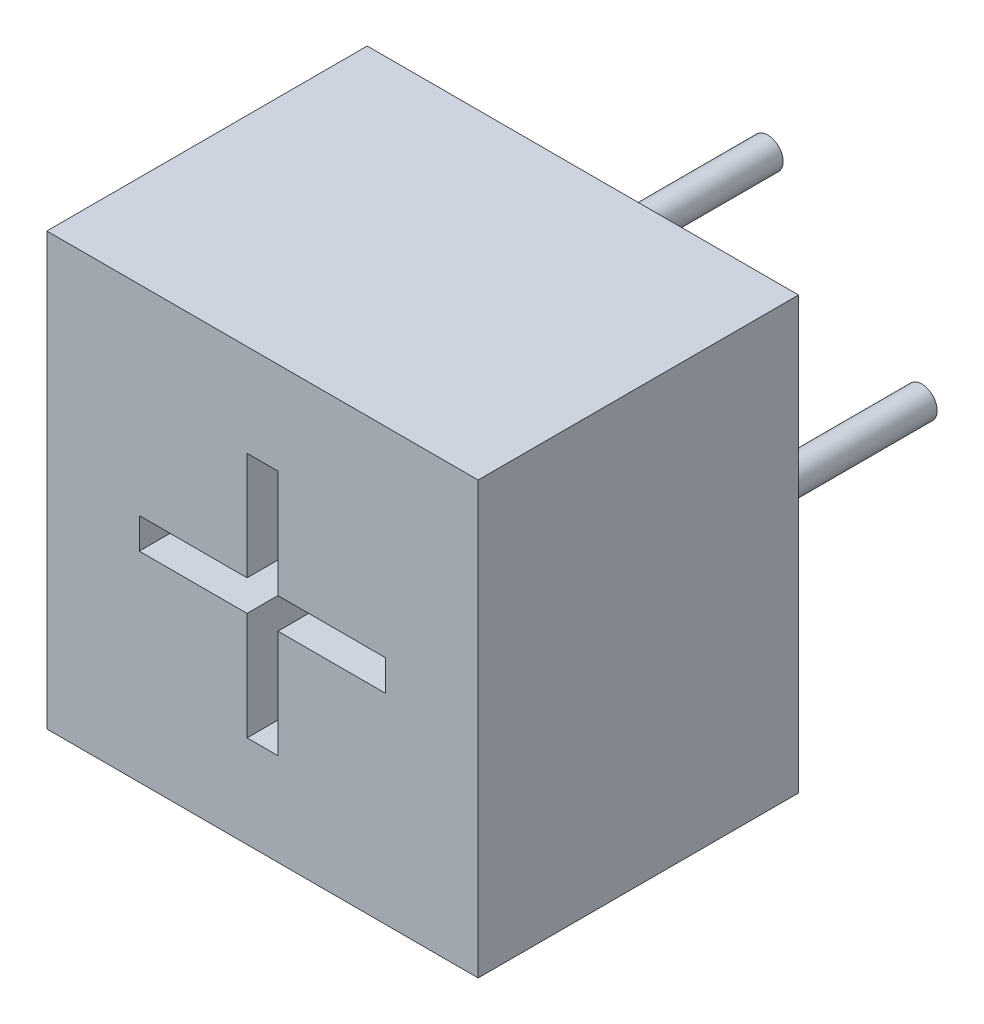
ISO-10303-21;
HEADER;
FILE_DESCRIPTION(('STEP AP214'),'2;1');
FILE_NAME('part.step','',(''),(''),'','','');
FILE_SCHEMA(('AUTOMOTIVE_DESIGN { 1 0 10303 214 1 1 1 1 }'));
ENDSEC;
DATA;
#1=APPLICATION_CONTEXT('core data for automotive mechanical design processes');
#2=APPLICATION_PROTOCOL_DEFINITION('international standard','automotive_design',2000,#1);
#3=PRODUCT_CONTEXT('',#1,'mechanical');
#4=PRODUCT('Part','Part','',(#3));
#5=PRODUCT_RELATED_PRODUCT_CATEGORY('part','',(#4));
#6=PRODUCT_DEFINITION_FORMATION('','',#4);
#7=PRODUCT_DEFINITION_CONTEXT('part definition',#1,'design');
#8=PRODUCT_DEFINITION('design','',#6,#7);
#9=PRODUCT_DEFINITION_SHAPE('','',#8);
#10=(LENGTH_UNIT() NAMED_UNIT(*) SI_UNIT(.MILLI.,.METRE.));
#11=(NAMED_UNIT(*) PLANE_ANGLE_UNIT() SI_UNIT($,.RADIAN.));
#12=(NAMED_UNIT(*) SI_UNIT($,.STERADIAN.) SOLID_ANGLE_UNIT());
#13=UNCERTAINTY_MEASURE_WITH_UNIT(LENGTH_MEASURE(1.E-05),#10,'distance_accuracy_value','');
#14=(GEOMETRIC_REPRESENTATION_CONTEXT(3) GLOBAL_UNCERTAINTY_ASSIGNED_CONTEXT((#13)) GLOBAL_UNIT_ASSIGNED_CONTEXT((#10,
#11,#12)) REPRESENTATION_CONTEXT('',''));
#15=CARTESIAN_POINT('',(0.,0.,0.));
#16=DIRECTION('',(0.,0.,1.));
#17=DIRECTION('',(1.,0.,0.));
#18=AXIS2_PLACEMENT_3D('',#15,#16,#17);
#19=CARTESIAN_POINT('',(3.5,-3.5,5.2));
#20=DIRECTION('',(-1.,0.,0.));
#21=DIRECTION('',(0.,0.,1.));
#22=AXIS2_PLACEMENT_3D('',#19,#20,#21);
#23=PLANE('',#22);
#24=DIRECTION('',(0.,1.,0.));
#25=VECTOR('',#24,1.);
#26=CARTESIAN_POINT('',(3.5,-3.5,0.));
#27=LINE('',#26,#25);
#28=CARTESIAN_POINT('',(3.5,-3.5,0.));
#29=VERTEX_POINT('',#28);
#30=CARTESIAN_POINT('',(3.5,3.5,0.));
#31=VERTEX_POINT('',#30);
#32=EDGE_CURVE('E295',#29,#31,#27,.T.);
#33=ORIENTED_EDGE('',*,*,#32,.T.);
#34=DIRECTION('',(0.,0.,-1.));
#35=VECTOR('',#34,1.);
#36=CARTESIAN_POINT('',(3.5,3.5,5.2));
#37=LINE('',#36,#35);
#38=CARTESIAN_POINT('',(3.5,3.5,5.2));
#39=VERTEX_POINT('',#38);
#40=EDGE_CURVE('E12',#39,#31,#37,.T.);
#41=ORIENTED_EDGE('',*,*,#40,.F.);
#42=DIRECTION('',(0.,1.,0.));
#43=VECTOR('',#42,1.);
#44=CARTESIAN_POINT('',(3.5,-3.5,5.2));
#45=LINE('',#44,#43);
#46=CARTESIAN_POINT('',(3.5,-3.5,5.2));
#47=VERTEX_POINT('',#46);
#48=EDGE_CURVE('E296',#47,#39,#45,.T.);
#49=ORIENTED_EDGE('',*,*,#48,.F.);
#50=DIRECTION('',(0.,0.,-1.));
#51=VECTOR('',#50,1.);
#52=CARTESIAN_POINT('',(3.5,-3.5,5.2));
#53=LINE('',#52,#51);
#54=EDGE_CURVE('E302',#47,#29,#53,.T.);
#55=ORIENTED_EDGE('',*,*,#54,.T.);
#56=EDGE_LOOP('',(#33,#41,#49,#55));
#57=FACE_BOUND('',#56,.T.);
#58=ADVANCED_FACE('F71',(#57),#23,.F.);
#59=CARTESIAN_POINT('',(-3.5,3.5,5.2));
#60=DIRECTION('',(0.,-1.,0.));
#61=DIRECTION('',(0.,0.,-1.));
#62=AXIS2_PLACEMENT_3D('',#59,#60,#61);
#63=PLANE('',#62);
#64=DIRECTION('',(-1.,0.,0.));
#65=VECTOR('',#64,1.);
#66=CARTESIAN_POINT('',(-3.5,3.5,0.));
#67=LINE('',#66,#65);
#68=CARTESIAN_POINT('',(-3.5,3.5,0.));
#69=VERTEX_POINT('',#68);
#70=EDGE_CURVE('E305',#31,#69,#67,.T.);
#71=ORIENTED_EDGE('',*,*,#70,.T.);
#72=DIRECTION('',(0.,0.,-1.));
#73=VECTOR('',#72,1.);
#74=CARTESIAN_POINT('',(-3.5,3.5,5.2));
#75=LINE('',#74,#73);
#76=CARTESIAN_POINT('',(-3.5,3.5,5.2));
#77=VERTEX_POINT('',#76);
#78=EDGE_CURVE('E78',#77,#69,#75,.T.);
#79=ORIENTED_EDGE('',*,*,#78,.F.);
#80=DIRECTION('',(-1.,0.,0.));
#81=VECTOR('',#80,1.);
#82=CARTESIAN_POINT('',(-3.5,3.5,5.2));
#83=LINE('',#82,#81);
#84=EDGE_CURVE('E122',#39,#77,#83,.T.);
#85=ORIENTED_EDGE('',*,*,#84,.F.);
#86=ORIENTED_EDGE('',*,*,#40,.T.);
#87=EDGE_LOOP('',(#71,#79,#85,#86));
#88=FACE_BOUND('',#87,.T.);
#89=ADVANCED_FACE('F334',(#88),#63,.F.);
#90=CARTESIAN_POINT('',(-3.5,-3.5,5.2));
#91=DIRECTION('',(1.,0.,0.));
#92=DIRECTION('',(0.,0.,-1.));
#93=AXIS2_PLACEMENT_3D('',#90,#91,#92);
#94=PLANE('',#93);
#95=DIRECTION('',(0.,-1.,0.));
#96=VECTOR('',#95,1.);
#97=CARTESIAN_POINT('',(-3.5,-3.5,0.));
#98=LINE('',#97,#96);
#99=CARTESIAN_POINT('',(-3.5,-3.5,0.));
#100=VERTEX_POINT('',#99);
#101=EDGE_CURVE('E307',#69,#100,#98,.T.);
#102=ORIENTED_EDGE('',*,*,#101,.T.);
#103=DIRECTION('',(0.,0.,-1.));
#104=VECTOR('',#103,1.);
#105=CARTESIAN_POINT('',(-3.5,-3.5,5.2));
#106=LINE('',#105,#104);
#107=CARTESIAN_POINT('',(-3.5,-3.5,5.2));
#108=VERTEX_POINT('',#107);
#109=EDGE_CURVE('E311',#108,#100,#106,.T.);
#110=ORIENTED_EDGE('',*,*,#109,.F.);
#111=DIRECTION('',(0.,-1.,0.));
#112=VECTOR('',#111,1.);
#113=CARTESIAN_POINT('',(-3.5,-3.5,5.2));
#114=LINE('',#113,#112);
#115=EDGE_CURVE('E299',#77,#108,#114,.T.);
#116=ORIENTED_EDGE('',*,*,#115,.F.);
#117=ORIENTED_EDGE('',*,*,#78,.T.);
#118=EDGE_LOOP('',(#102,#110,#116,#117));
#119=FACE_BOUND('',#118,.T.);
#120=ADVANCED_FACE('F316',(#119),#94,.F.);
#121=CARTESIAN_POINT('',(-3.5,-3.5,5.2));
#122=DIRECTION('',(0.,1.,0.));
#123=DIRECTION('',(0.,0.,1.));
#124=AXIS2_PLACEMENT_3D('',#121,#122,#123);
#125=PLANE('',#124);
#126=DIRECTION('',(1.,0.,0.));
#127=VECTOR('',#126,1.);
#128=CARTESIAN_POINT('',(-3.5,-3.5,0.));
#129=LINE('',#128,#127);
#130=EDGE_CURVE('E115',#100,#29,#129,.T.);
#131=ORIENTED_EDGE('',*,*,#130,.T.);
#132=ORIENTED_EDGE('',*,*,#54,.F.);
#133=DIRECTION('',(1.,0.,0.));
#134=VECTOR('',#133,1.);
#135=CARTESIAN_POINT('',(-3.5,-3.5,5.2));
#136=LINE('',#135,#134);
#137=EDGE_CURVE('E94',#108,#47,#136,.T.);
#138=ORIENTED_EDGE('',*,*,#137,.F.);
#139=ORIENTED_EDGE('',*,*,#109,.T.);
#140=EDGE_LOOP('',(#131,#132,#138,#139));
#141=FACE_BOUND('',#140,.T.);
#142=ADVANCED_FACE('F324',(#141),#125,.F.);
#143=CARTESIAN_POINT('',(0.,0.,5.2));
#144=DIRECTION('',(0.,0.,-1.));
#145=DIRECTION('',(-1.,0.,0.));
#146=AXIS2_PLACEMENT_3D('',#143,#144,#145);
#147=PLANE('',#146);
#148=DIRECTION('',(0.,1.,0.));
#149=VECTOR('',#148,1.);
#150=CARTESIAN_POINT('',(0.25,0.,5.2));
#151=LINE('',#150,#149);
#152=CARTESIAN_POINT('',(0.25,0.25,5.2));
#153=VERTEX_POINT('',#152);
#154=CARTESIAN_POINT('',(0.25,2.,5.2));
#155=VERTEX_POINT('',#154);
#156=EDGE_CURVE('E241',#153,#155,#151,.T.);
#157=ORIENTED_EDGE('',*,*,#156,.F.);
#158=DIRECTION('',(-1.,0.,0.));
#159=VECTOR('',#158,1.);
#160=CARTESIAN_POINT('',(0.,0.25,5.2));
#161=LINE('',#160,#159);
#162=CARTESIAN_POINT('',(2.,0.25,5.2));
#163=VERTEX_POINT('',#162);
#164=EDGE_CURVE('E199',#163,#153,#161,.T.);
#165=ORIENTED_EDGE('',*,*,#164,.F.);
#166=DIRECTION('',(0.,1.,0.));
#167=VECTOR('',#166,1.);
#168=CARTESIAN_POINT('',(2.,0.,5.2));
#169=LINE('',#168,#167);
#170=CARTESIAN_POINT('',(2.,-0.25,5.2));
#171=VERTEX_POINT('',#170);
#172=EDGE_CURVE('E217',#171,#163,#169,.T.);
#173=ORIENTED_EDGE('',*,*,#172,.F.);
#174=DIRECTION('',(-1.,0.,0.));
#175=VECTOR('',#174,1.);
#176=CARTESIAN_POINT('',(0.,-0.25,5.2));
#177=LINE('',#176,#175);
#178=CARTESIAN_POINT('',(0.25,-0.25,5.2));
#179=VERTEX_POINT('',#178);
#180=EDGE_CURVE('E220',#171,#179,#177,.T.);
#181=ORIENTED_EDGE('',*,*,#180,.T.);
#182=DIRECTION('',(0.,1.,0.));
#183=VECTOR('',#182,1.);
#184=CARTESIAN_POINT('',(0.25,0.,5.2));
#185=LINE('',#184,#183);
#186=CARTESIAN_POINT('',(0.25,-2.,5.2));
#187=VERTEX_POINT('',#186);
#188=EDGE_CURVE('E253',#187,#179,#185,.T.);
#189=ORIENTED_EDGE('',*,*,#188,.F.);
#190=DIRECTION('',(-1.,0.,0.));
#191=VECTOR('',#190,1.);
#192=CARTESIAN_POINT('',(0.,-2.,5.2));
#193=LINE('',#192,#191);
#194=CARTESIAN_POINT('',(-0.25,-2.,5.2));
#195=VERTEX_POINT('',#194);
#196=EDGE_CURVE('E250',#187,#195,#193,.T.);
#197=ORIENTED_EDGE('',*,*,#196,.T.);
#198=DIRECTION('',(0.,1.,0.));
#199=VECTOR('',#198,1.);
#200=CARTESIAN_POINT('',(-0.25,0.,5.2));
#201=LINE('',#200,#199);
#202=CARTESIAN_POINT('',(-0.25,-0.25,5.2));
#203=VERTEX_POINT('',#202);
#204=EDGE_CURVE('E247',#195,#203,#201,.T.);
#205=ORIENTED_EDGE('',*,*,#204,.T.);
#206=DIRECTION('',(-1.,0.,0.));
#207=VECTOR('',#206,1.);
#208=CARTESIAN_POINT('',(2.,-0.25,5.2));
#209=LINE('',#208,#207);
#210=CARTESIAN_POINT('',(-2.,-0.25,5.2));
#211=VERTEX_POINT('',#210);
#212=EDGE_CURVE('E275',#203,#211,#209,.T.);
#213=ORIENTED_EDGE('',*,*,#212,.T.);
#214=DIRECTION('',(0.,1.,0.));
#215=VECTOR('',#214,1.);
#216=CARTESIAN_POINT('',(-2.,-0.25,5.2));
#217=LINE('',#216,#215);
#218=CARTESIAN_POINT('',(-2.,0.25,5.2));
#219=VERTEX_POINT('',#218);
#220=EDGE_CURVE('E283',#211,#219,#217,.T.);
#221=ORIENTED_EDGE('',*,*,#220,.T.);
#222=DIRECTION('',(-1.,0.,0.));
#223=VECTOR('',#222,1.);
#224=CARTESIAN_POINT('',(2.,0.25,5.2));
#225=LINE('',#224,#223);
#226=CARTESIAN_POINT('',(-0.25,0.25,5.2));
#227=VERTEX_POINT('',#226);
#228=EDGE_CURVE('E281',#227,#219,#225,.T.);
#229=ORIENTED_EDGE('',*,*,#228,.F.);
#230=CARTESIAN_POINT('',(-0.25,2.,5.2));
#231=VERTEX_POINT('',#230);
#232=EDGE_CURVE('E85',#227,#231,#201,.T.);
#233=ORIENTED_EDGE('',*,*,#232,.T.);
#234=DIRECTION('',(-1.,0.,0.));
#235=VECTOR('',#234,1.);
#236=CARTESIAN_POINT('',(0.,2.,5.2));
#237=LINE('',#236,#235);
#238=EDGE_CURVE('E244',#155,#231,#237,.T.);
#239=ORIENTED_EDGE('',*,*,#238,.F.);
#240=EDGE_LOOP('',(#157,#165,#173,#181,#189,#197,#205,#213,#221,#229,#233,#239));
#241=FACE_BOUND('',#240,.T.);
#242=ORIENTED_EDGE('',*,*,#48,.T.);
#243=ORIENTED_EDGE('',*,*,#84,.T.);
#244=ORIENTED_EDGE('',*,*,#115,.T.);
#245=ORIENTED_EDGE('',*,*,#137,.T.);
#246=EDGE_LOOP('',(#242,#243,#244,#245));
#247=FACE_BOUND('',#246,.T.);
#248=ADVANCED_FACE('F326',(#241,#247),#147,.F.);
#249=CARTESIAN_POINT('',(0.,0.,0.));
#250=DIRECTION('',(0.,0.,-1.));
#251=DIRECTION('',(-1.,0.,0.));
#252=AXIS2_PLACEMENT_3D('',#249,#250,#251);
#253=PLANE('',#252);
#254=CARTESIAN_POINT('',(2.5,0.,0.));
#255=DIRECTION('',(0.,0.,-1.));
#256=DIRECTION('',(-1.,0.,0.));
#257=AXIS2_PLACEMENT_3D('',#254,#255,#256);
#258=CIRCLE('',#257,0.249999999999999);
#259=CARTESIAN_POINT('',(2.25,0.,0.));
#260=VERTEX_POINT('',#259);
#261=EDGE_CURVE('E560',#260,#260,#258,.T.);
#262=ORIENTED_EDGE('',*,*,#261,.F.);
#263=EDGE_LOOP('',(#262));
#264=FACE_BOUND('',#263,.T.);
#265=CARTESIAN_POINT('',(-2.5,0.,0.));
#266=DIRECTION('',(0.,0.,-1.));
#267=DIRECTION('',(-1.,0.,0.));
#268=AXIS2_PLACEMENT_3D('',#265,#266,#267);
#269=CIRCLE('',#268,0.249999999999999);
#270=CARTESIAN_POINT('',(-2.75,0.,0.));
#271=VERTEX_POINT('',#270);
#272=EDGE_CURVE('E559',#271,#271,#269,.T.);
#273=ORIENTED_EDGE('',*,*,#272,.F.);
#274=EDGE_LOOP('',(#273));
#275=FACE_BOUND('',#274,.T.);
#276=CARTESIAN_POINT('',(0.,2.25,0.));
#277=DIRECTION('',(0.,0.,-1.));
#278=DIRECTION('',(-1.,0.,0.));
#279=AXIS2_PLACEMENT_3D('',#276,#277,#278);
#280=CIRCLE('',#279,0.25);
#281=CARTESIAN_POINT('',(-0.25,2.25,0.));
#282=VERTEX_POINT('',#281);
#283=EDGE_CURVE('E223',#282,#282,#280,.T.);
#284=ORIENTED_EDGE('',*,*,#283,.F.);
#285=EDGE_LOOP('',(#284));
#286=FACE_BOUND('',#285,.T.);
#287=ORIENTED_EDGE('',*,*,#32,.F.);
#288=ORIENTED_EDGE('',*,*,#130,.F.);
#289=ORIENTED_EDGE('',*,*,#101,.F.);
#290=ORIENTED_EDGE('',*,*,#70,.F.);
#291=EDGE_LOOP('',(#287,#288,#289,#290));
#292=FACE_BOUND('',#291,.T.);
#293=ADVANCED_FACE('F320',(#264,#275,#286,#292),#253,.T.);
#294=CARTESIAN_POINT('',(0.,0.25,3.2));
#295=DIRECTION('',(0.,1.,0.));
#296=DIRECTION('',(-1.,0.,0.));
#297=AXIS2_PLACEMENT_3D('',#294,#295,#296);
#298=PLANE('',#297);
#299=ORIENTED_EDGE('',*,*,#164,.T.);
#300=DIRECTION('',(0.,0.,1.));
#301=VECTOR('',#300,1.);
#302=CARTESIAN_POINT('',(0.25,0.25,3.2));
#303=LINE('',#302,#301);
#304=CARTESIAN_POINT('',(0.25,0.25,3.2));
#305=VERTEX_POINT('',#304);
#306=EDGE_CURVE('E192',#305,#153,#303,.T.);
#307=ORIENTED_EDGE('',*,*,#306,.F.);
#308=DIRECTION('',(-1.,0.,0.));
#309=VECTOR('',#308,1.);
#310=CARTESIAN_POINT('',(0.,0.25,3.2));
#311=LINE('',#310,#309);
#312=CARTESIAN_POINT('',(2.,0.25,3.2));
#313=VERTEX_POINT('',#312);
#314=EDGE_CURVE('E196',#313,#305,#311,.T.);
#315=ORIENTED_EDGE('',*,*,#314,.F.);
#316=DIRECTION('',(0.,0.,1.));
#317=VECTOR('',#316,1.);
#318=CARTESIAN_POINT('',(2.,0.25,3.2));
#319=LINE('',#318,#317);
#320=EDGE_CURVE('E258',#313,#163,#319,.T.);
#321=ORIENTED_EDGE('',*,*,#320,.T.);
#322=EDGE_LOOP('',(#299,#307,#315,#321));
#323=FACE_BOUND('',#322,.T.);
#324=ADVANCED_FACE('F194',(#323),#298,.F.);
#325=CARTESIAN_POINT('',(0.,-0.25,3.2));
#326=DIRECTION('',(0.,1.,0.));
#327=DIRECTION('',(-1.,0.,0.));
#328=AXIS2_PLACEMENT_3D('',#325,#326,#327);
#329=PLANE('',#328);
#330=ORIENTED_EDGE('',*,*,#180,.F.);
#331=DIRECTION('',(0.,0.,1.));
#332=VECTOR('',#331,1.);
#333=CARTESIAN_POINT('',(2.,-0.25,3.2));
#334=LINE('',#333,#332);
#335=CARTESIAN_POINT('',(2.,-0.25,3.2));
#336=VERTEX_POINT('',#335);
#337=EDGE_CURVE('E261',#336,#171,#334,.T.);
#338=ORIENTED_EDGE('',*,*,#337,.F.);
#339=DIRECTION('',(-1.,0.,0.));
#340=VECTOR('',#339,1.);
#341=CARTESIAN_POINT('',(0.,-0.25,3.2));
#342=LINE('',#341,#340);
#343=CARTESIAN_POINT('',(0.25,-0.25,3.2));
#344=VERTEX_POINT('',#343);
#345=EDGE_CURVE('E236',#336,#344,#342,.T.);
#346=ORIENTED_EDGE('',*,*,#345,.T.);
#347=DIRECTION('',(0.,0.,1.));
#348=VECTOR('',#347,1.);
#349=CARTESIAN_POINT('',(0.25,-0.25,3.2));
#350=LINE('',#349,#348);
#351=EDGE_CURVE('E263',#344,#179,#350,.T.);
#352=ORIENTED_EDGE('',*,*,#351,.T.);
#353=EDGE_LOOP('',(#330,#338,#346,#352));
#354=FACE_BOUND('',#353,.T.);
#355=ADVANCED_FACE('F368',(#354),#329,.T.);
#356=CARTESIAN_POINT('',(2.,0.,3.2));
#357=DIRECTION('',(1.,0.,0.));
#358=DIRECTION('',(0.,0.,-1.));
#359=AXIS2_PLACEMENT_3D('',#356,#357,#358);
#360=PLANE('',#359);
#361=ORIENTED_EDGE('',*,*,#172,.T.);
#362=ORIENTED_EDGE('',*,*,#320,.F.);
#363=DIRECTION('',(0.,1.,0.));
#364=VECTOR('',#363,1.);
#365=CARTESIAN_POINT('',(2.,0.,3.2));
#366=LINE('',#365,#364);
#367=EDGE_CURVE('E204',#336,#313,#366,.T.);
#368=ORIENTED_EDGE('',*,*,#367,.F.);
#369=ORIENTED_EDGE('',*,*,#337,.T.);
#370=EDGE_LOOP('',(#361,#362,#368,#369));
#371=FACE_BOUND('',#370,.T.);
#372=ADVANCED_FACE('F380',(#371),#360,.F.);
#373=CARTESIAN_POINT('',(-0.25,0.,3.2));
#374=DIRECTION('',(1.,0.,0.));
#375=DIRECTION('',(0.,0.,-1.));
#376=AXIS2_PLACEMENT_3D('',#373,#374,#375);
#377=PLANE('',#376);
#378=DIRECTION('',(0.,1.,0.));
#379=VECTOR('',#378,1.);
#380=CARTESIAN_POINT('',(-0.25,0.,3.2));
#381=LINE('',#380,#379);
#382=CARTESIAN_POINT('',(-0.25,0.25,3.2));
#383=VERTEX_POINT('',#382);
#384=CARTESIAN_POINT('',(-0.25,2.,3.2));
#385=VERTEX_POINT('',#384);
#386=EDGE_CURVE('E227',#383,#385,#381,.T.);
#387=ORIENTED_EDGE('',*,*,#386,.T.);
#388=DIRECTION('',(0.,0.,1.));
#389=VECTOR('',#388,1.);
#390=CARTESIAN_POINT('',(-0.25,2.,3.2));
#391=LINE('',#390,#389);
#392=EDGE_CURVE('E269',#385,#231,#391,.T.);
#393=ORIENTED_EDGE('',*,*,#392,.T.);
#394=ORIENTED_EDGE('',*,*,#232,.F.);
#395=DIRECTION('',(0.,0.,1.));
#396=VECTOR('',#395,1.);
#397=CARTESIAN_POINT('',(-0.25,0.25,3.2));
#398=LINE('',#397,#396);
#399=EDGE_CURVE('E260',#383,#227,#398,.T.);
#400=ORIENTED_EDGE('',*,*,#399,.F.);
#401=EDGE_LOOP('',(#387,#393,#394,#400));
#402=FACE_BOUND('',#401,.T.);
#403=ADVANCED_FACE('F392',(#402),#377,.T.);
#404=CARTESIAN_POINT('',(0.,2.,3.2));
#405=DIRECTION('',(0.,1.,0.));
#406=DIRECTION('',(0.,0.,1.));
#407=AXIS2_PLACEMENT_3D('',#404,#405,#406);
#408=PLANE('',#407);
#409=ORIENTED_EDGE('',*,*,#238,.T.);
#410=ORIENTED_EDGE('',*,*,#392,.F.);
#411=DIRECTION('',(-1.,0.,0.));
#412=VECTOR('',#411,1.);
#413=CARTESIAN_POINT('',(0.,2.,3.2));
#414=LINE('',#413,#412);
#415=CARTESIAN_POINT('',(0.25,2.,3.2));
#416=VERTEX_POINT('',#415);
#417=EDGE_CURVE('E212',#416,#385,#414,.T.);
#418=ORIENTED_EDGE('',*,*,#417,.F.);
#419=DIRECTION('',(0.,0.,1.));
#420=VECTOR('',#419,1.);
#421=CARTESIAN_POINT('',(0.25,2.,3.2));
#422=LINE('',#421,#420);
#423=EDGE_CURVE('E203',#416,#155,#422,.T.);
#424=ORIENTED_EDGE('',*,*,#423,.T.);
#425=EDGE_LOOP('',(#409,#410,#418,#424));
#426=FACE_BOUND('',#425,.T.);
#427=ADVANCED_FACE('F403',(#426),#408,.F.);
#428=CARTESIAN_POINT('',(0.25,0.,3.2));
#429=DIRECTION('',(1.,0.,0.));
#430=DIRECTION('',(0.,1.,0.));
#431=AXIS2_PLACEMENT_3D('',#428,#429,#430);
#432=PLANE('',#431);
#433=ORIENTED_EDGE('',*,*,#156,.T.);
#434=ORIENTED_EDGE('',*,*,#423,.F.);
#435=DIRECTION('',(0.,1.,0.));
#436=VECTOR('',#435,1.);
#437=CARTESIAN_POINT('',(0.25,0.,3.2));
#438=LINE('',#437,#436);
#439=EDGE_CURVE('E207',#305,#416,#438,.T.);
#440=ORIENTED_EDGE('',*,*,#439,.F.);
#441=ORIENTED_EDGE('',*,*,#306,.T.);
#442=EDGE_LOOP('',(#433,#434,#440,#441));
#443=FACE_BOUND('',#442,.T.);
#444=ADVANCED_FACE('F208',(#443),#432,.F.);
#445=CARTESIAN_POINT('',(0.,0.,3.2));
#446=DIRECTION('',(0.,0.,1.));
#447=DIRECTION('',(1.,0.,0.));
#448=AXIS2_PLACEMENT_3D('',#445,#446,#447);
#449=PLANE('',#448);
#450=ORIENTED_EDGE('',*,*,#439,.T.);
#451=ORIENTED_EDGE('',*,*,#417,.T.);
#452=ORIENTED_EDGE('',*,*,#386,.F.);
#453=DIRECTION('',(-1.,0.,0.));
#454=VECTOR('',#453,1.);
#455=CARTESIAN_POINT('',(2.,0.25,3.2));
#456=LINE('',#455,#454);
#457=CARTESIAN_POINT('',(-2.,0.25,3.2));
#458=VERTEX_POINT('',#457);
#459=EDGE_CURVE('E272',#383,#458,#456,.T.);
#460=ORIENTED_EDGE('',*,*,#459,.T.);
#461=DIRECTION('',(0.,1.,0.));
#462=VECTOR('',#461,1.);
#463=CARTESIAN_POINT('',(-2.,-0.25,3.2));
#464=LINE('',#463,#462);
#465=CARTESIAN_POINT('',(-2.,-0.25,3.2));
#466=VERTEX_POINT('',#465);
#467=EDGE_CURVE('E274',#466,#458,#464,.T.);
#468=ORIENTED_EDGE('',*,*,#467,.F.);
#469=DIRECTION('',(-1.,0.,0.));
#470=VECTOR('',#469,1.);
#471=CARTESIAN_POINT('',(2.,-0.25,3.2));
#472=LINE('',#471,#470);
#473=CARTESIAN_POINT('',(-0.25,-0.25,3.2));
#474=VERTEX_POINT('',#473);
#475=EDGE_CURVE('E278',#474,#466,#472,.T.);
#476=ORIENTED_EDGE('',*,*,#475,.F.);
#477=CARTESIAN_POINT('',(-0.25,-2.,3.2));
#478=VERTEX_POINT('',#477);
#479=EDGE_CURVE('E228',#478,#474,#381,.T.);
#480=ORIENTED_EDGE('',*,*,#479,.F.);
#481=DIRECTION('',(-1.,0.,0.));
#482=VECTOR('',#481,1.);
#483=CARTESIAN_POINT('',(0.,-2.,3.2));
#484=LINE('',#483,#482);
#485=CARTESIAN_POINT('',(0.25,-2.,3.2));
#486=VERTEX_POINT('',#485);
#487=EDGE_CURVE('E231',#486,#478,#484,.T.);
#488=ORIENTED_EDGE('',*,*,#487,.F.);
#489=DIRECTION('',(0.,1.,0.));
#490=VECTOR('',#489,1.);
#491=CARTESIAN_POINT('',(0.25,0.,3.2));
#492=LINE('',#491,#490);
#493=EDGE_CURVE('E233',#486,#344,#492,.T.);
#494=ORIENTED_EDGE('',*,*,#493,.T.);
#495=ORIENTED_EDGE('',*,*,#345,.F.);
#496=ORIENTED_EDGE('',*,*,#367,.T.);
#497=ORIENTED_EDGE('',*,*,#314,.T.);
#498=EDGE_LOOP('',(#450,#451,#452,#460,#468,#476,#480,#488,#494,#495,#496,#497));
#499=FACE_BOUND('',#498,.T.);
#500=ADVANCED_FACE('F214',(#499),#449,.T.);
#501=CARTESIAN_POINT('',(0.,-2.,3.2));
#502=DIRECTION('',(0.,1.,0.));
#503=DIRECTION('',(0.,0.,1.));
#504=AXIS2_PLACEMENT_3D('',#501,#502,#503);
#505=PLANE('',#504);
#506=ORIENTED_EDGE('',*,*,#196,.F.);
#507=DIRECTION('',(0.,0.,1.));
#508=VECTOR('',#507,1.);
#509=CARTESIAN_POINT('',(0.25,-2.,3.2));
#510=LINE('',#509,#508);
#511=EDGE_CURVE('E265',#486,#187,#510,.T.);
#512=ORIENTED_EDGE('',*,*,#511,.F.);
#513=ORIENTED_EDGE('',*,*,#487,.T.);
#514=DIRECTION('',(0.,0.,1.));
#515=VECTOR('',#514,1.);
#516=CARTESIAN_POINT('',(-0.25,-2.,3.2));
#517=LINE('',#516,#515);
#518=EDGE_CURVE('E267',#478,#195,#517,.T.);
#519=ORIENTED_EDGE('',*,*,#518,.T.);
#520=EDGE_LOOP('',(#506,#512,#513,#519));
#521=FACE_BOUND('',#520,.T.);
#522=ADVANCED_FACE('F370',(#521),#505,.T.);
#523=DIRECTION('',(0.,0.,1.));
#524=VECTOR('',#523,1.);
#525=CARTESIAN_POINT('',(-0.25,-0.25,3.2));
#526=LINE('',#525,#524);
#527=EDGE_CURVE('E293',#474,#203,#526,.T.);
#528=ORIENTED_EDGE('',*,*,#527,.T.);
#529=ORIENTED_EDGE('',*,*,#204,.F.);
#530=ORIENTED_EDGE('',*,*,#518,.F.);
#531=ORIENTED_EDGE('',*,*,#479,.T.);
#532=EDGE_LOOP('',(#528,#529,#530,#531));
#533=FACE_BOUND('',#532,.T.);
#534=ADVANCED_FACE('F405',(#533),#377,.T.);
#535=CARTESIAN_POINT('',(0.25,0.,3.2));
#536=DIRECTION('',(1.,0.,0.));
#537=DIRECTION('',(0.,1.,0.));
#538=AXIS2_PLACEMENT_3D('',#535,#536,#537);
#539=PLANE('',#538);
#540=ORIENTED_EDGE('',*,*,#188,.T.);
#541=ORIENTED_EDGE('',*,*,#351,.F.);
#542=ORIENTED_EDGE('',*,*,#493,.F.);
#543=ORIENTED_EDGE('',*,*,#511,.T.);
#544=EDGE_LOOP('',(#540,#541,#542,#543));
#545=FACE_BOUND('',#544,.T.);
#546=ADVANCED_FACE('F383',(#545),#539,.F.);
#547=CARTESIAN_POINT('',(2.,-0.25,3.2));
#548=DIRECTION('',(0.,1.,0.));
#549=DIRECTION('',(-1.,0.,0.));
#550=AXIS2_PLACEMENT_3D('',#547,#548,#549);
#551=PLANE('',#550);
#552=ORIENTED_EDGE('',*,*,#475,.T.);
#553=DIRECTION('',(0.,0.,1.));
#554=VECTOR('',#553,1.);
#555=CARTESIAN_POINT('',(-2.,-0.25,3.2));
#556=LINE('',#555,#554);
#557=EDGE_CURVE('E242',#466,#211,#556,.T.);
#558=ORIENTED_EDGE('',*,*,#557,.T.);
#559=ORIENTED_EDGE('',*,*,#212,.F.);
#560=ORIENTED_EDGE('',*,*,#527,.F.);
#561=EDGE_LOOP('',(#552,#558,#559,#560));
#562=FACE_BOUND('',#561,.T.);
#563=ADVANCED_FACE('F395',(#562),#551,.T.);
#564=CARTESIAN_POINT('',(-2.,-0.25,3.2));
#565=DIRECTION('',(1.,0.,0.));
#566=DIRECTION('',(0.,0.,-1.));
#567=AXIS2_PLACEMENT_3D('',#564,#565,#566);
#568=PLANE('',#567);
#569=ORIENTED_EDGE('',*,*,#220,.F.);
#570=ORIENTED_EDGE('',*,*,#557,.F.);
#571=ORIENTED_EDGE('',*,*,#467,.T.);
#572=DIRECTION('',(0.,0.,1.));
#573=VECTOR('',#572,1.);
#574=CARTESIAN_POINT('',(-2.,0.25,3.2));
#575=LINE('',#574,#573);
#576=EDGE_CURVE('E280',#458,#219,#575,.T.);
#577=ORIENTED_EDGE('',*,*,#576,.T.);
#578=EDGE_LOOP('',(#569,#570,#571,#577));
#579=FACE_BOUND('',#578,.T.);
#580=ADVANCED_FACE('F466',(#579),#568,.T.);
#581=CARTESIAN_POINT('',(2.,0.25,3.2));
#582=DIRECTION('',(0.,1.,0.));
#583=DIRECTION('',(-1.,0.,0.));
#584=AXIS2_PLACEMENT_3D('',#581,#582,#583);
#585=PLANE('',#584);
#586=ORIENTED_EDGE('',*,*,#399,.T.);
#587=ORIENTED_EDGE('',*,*,#228,.T.);
#588=ORIENTED_EDGE('',*,*,#576,.F.);
#589=ORIENTED_EDGE('',*,*,#459,.F.);
#590=EDGE_LOOP('',(#586,#587,#588,#589));
#591=FACE_BOUND('',#590,.T.);
#592=ADVANCED_FACE('F476',(#591),#585,.F.);
#593=CARTESIAN_POINT('',(0.,2.25,-3.));
#594=DIRECTION('',(0.,0.,1.));
#595=DIRECTION('',(1.,0.,0.));
#596=AXIS2_PLACEMENT_3D('',#593,#594,#595);
#597=CYLINDRICAL_SURFACE('',#596,0.25);
#598=CARTESIAN_POINT('',(0.,2.25,-3.));
#599=DIRECTION('',(0.,0.,-1.));
#600=DIRECTION('',(-1.,0.,0.));
#601=AXIS2_PLACEMENT_3D('',#598,#599,#600);
#602=CIRCLE('',#601,0.25);
#603=CARTESIAN_POINT('',(-0.25,2.25,-3.));
#604=VERTEX_POINT('',#603);
#605=EDGE_CURVE('E284',#604,#604,#602,.T.);
#606=ORIENTED_EDGE('',*,*,#605,.F.);
#607=EDGE_LOOP('',(#606));
#608=FACE_BOUND('',#607,.T.);
#609=ORIENTED_EDGE('',*,*,#283,.T.);
#610=EDGE_LOOP('',(#609));
#611=FACE_BOUND('',#610,.T.);
#612=ADVANCED_FACE('F486',(#608,#611),#597,.T.);
#613=CARTESIAN_POINT('',(0.,2.25,-3.));
#614=DIRECTION('',(0.,0.,-1.));
#615=DIRECTION('',(-1.,0.,0.));
#616=AXIS2_PLACEMENT_3D('',#613,#614,#615);
#617=PLANE('',#616);
#618=ORIENTED_EDGE('',*,*,#605,.T.);
#619=EDGE_LOOP('',(#618));
#620=FACE_BOUND('',#619,.T.);
#621=ADVANCED_FACE('F502',(#620),#617,.T.);
#622=CARTESIAN_POINT('',(-2.5,0.,-3.));
#623=DIRECTION('',(0.,0.,1.));
#624=DIRECTION('',(1.,0.,0.));
#625=AXIS2_PLACEMENT_3D('',#622,#623,#624);
#626=CYLINDRICAL_SURFACE('',#625,0.249999999999999);
#627=CARTESIAN_POINT('',(-2.5,0.,-3.));
#628=DIRECTION('',(0.,0.,-1.));
#629=DIRECTION('',(-1.,0.,0.));
#630=AXIS2_PLACEMENT_3D('',#627,#628,#629);
#631=CIRCLE('',#630,0.249999999999999);
#632=CARTESIAN_POINT('',(-2.75,0.,-3.));
#633=VERTEX_POINT('',#632);
#634=EDGE_CURVE('E563',#633,#633,#631,.T.);
#635=ORIENTED_EDGE('',*,*,#634,.F.);
#636=EDGE_LOOP('',(#635));
#637=FACE_BOUND('',#636,.T.);
#638=ORIENTED_EDGE('',*,*,#272,.T.);
#639=EDGE_LOOP('',(#638));
#640=FACE_BOUND('',#639,.T.);
#641=ADVANCED_FACE('F512',(#637,#640),#626,.T.);
#642=CARTESIAN_POINT('',(-2.5,0.,-3.));
#643=DIRECTION('',(0.,0.,-1.));
#644=DIRECTION('',(-1.,0.,0.));
#645=AXIS2_PLACEMENT_3D('',#642,#643,#644);
#646=PLANE('',#645);
#647=ORIENTED_EDGE('',*,*,#634,.T.);
#648=EDGE_LOOP('',(#647));
#649=FACE_BOUND('',#648,.T.);
#650=ADVANCED_FACE('F522',(#649),#646,.T.);
#651=CARTESIAN_POINT('',(2.5,0.,-3.));
#652=DIRECTION('',(0.,0.,1.));
#653=DIRECTION('',(1.,0.,0.));
#654=AXIS2_PLACEMENT_3D('',#651,#652,#653);
#655=CYLINDRICAL_SURFACE('',#654,0.249999999999999);
#656=CARTESIAN_POINT('',(2.5,0.,-3.));
#657=DIRECTION('',(0.,0.,-1.));
#658=DIRECTION('',(-1.,0.,0.));
#659=AXIS2_PLACEMENT_3D('',#656,#657,#658);
#660=CIRCLE('',#659,0.249999999999999);
#661=CARTESIAN_POINT('',(2.25,0.,-3.));
#662=VERTEX_POINT('',#661);
#663=EDGE_CURVE('E558',#662,#662,#660,.T.);
#664=ORIENTED_EDGE('',*,*,#663,.F.);
#665=EDGE_LOOP('',(#664));
#666=FACE_BOUND('',#665,.T.);
#667=ORIENTED_EDGE('',*,*,#261,.T.);
#668=EDGE_LOOP('',(#667));
#669=FACE_BOUND('',#668,.T.);
#670=ADVANCED_FACE('F532',(#666,#669),#655,.T.);
#671=CARTESIAN_POINT('',(2.5,0.,-3.));
#672=DIRECTION('',(0.,0.,-1.));
#673=DIRECTION('',(-1.,0.,0.));
#674=AXIS2_PLACEMENT_3D('',#671,#672,#673);
#675=PLANE('',#674);
#676=ORIENTED_EDGE('',*,*,#663,.T.);
#677=EDGE_LOOP('',(#676));
#678=FACE_BOUND('',#677,.T.);
#679=ADVANCED_FACE('F542',(#678),#675,.T.);
#680=CLOSED_SHELL('',(#58,#89,#120,#142,#248,#293,#324,#355,#372,#403,#427,#444,#500,#522,#534,
#546,#563,#580,#592,#612,#621,#641,#650,#670,#679));
#681=MANIFOLD_SOLID_BREP('B2',#680);
#682=ADVANCED_BREP_SHAPE_REPRESENTATION('',(#18,#681),#14);
#683=SHAPE_DEFINITION_REPRESENTATION(#9,#682);
ENDSEC;
END-ISO-10303-21;
